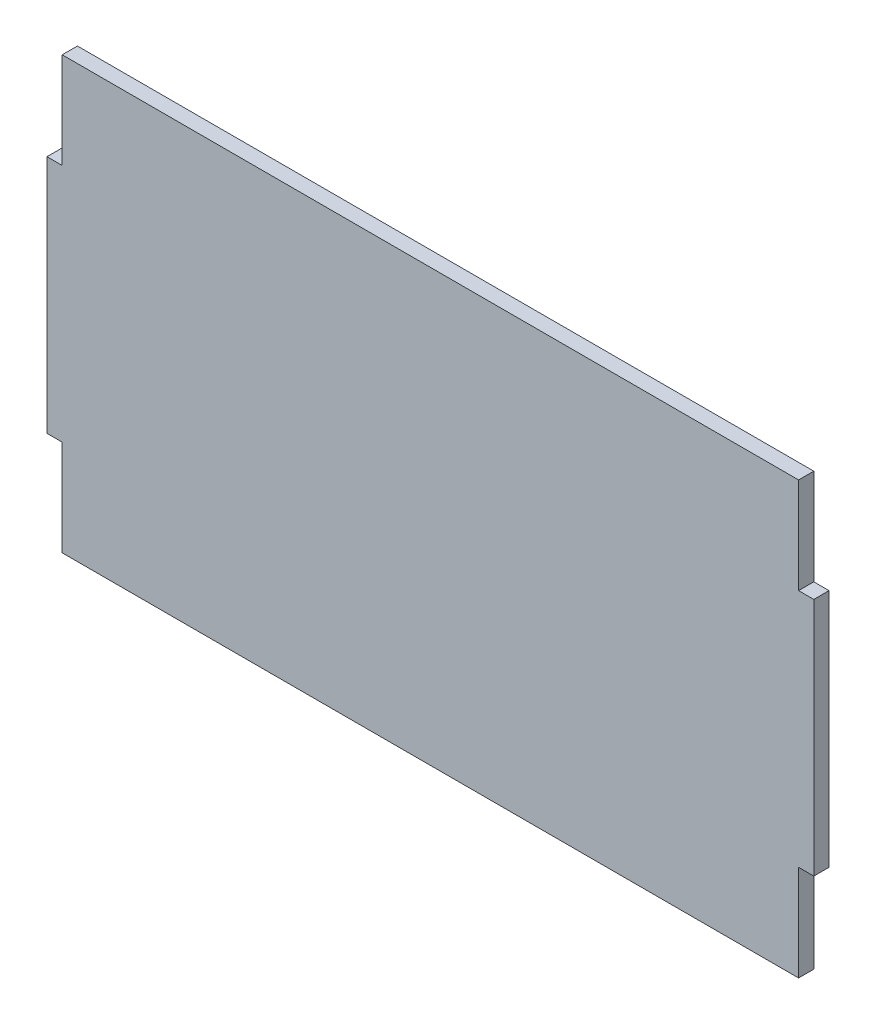
ISO-10303-21;
HEADER;
FILE_DESCRIPTION(('STEP AP214'),'2;1');
FILE_NAME('part.step','',(''),(''),'','','');
FILE_SCHEMA(('AUTOMOTIVE_DESIGN { 1 0 10303 214 1 1 1 1 }'));
ENDSEC;
DATA;
#1=APPLICATION_CONTEXT('core data for automotive mechanical design processes');
#2=APPLICATION_PROTOCOL_DEFINITION('international standard','automotive_design',2000,#1);
#3=PRODUCT_CONTEXT('',#1,'mechanical');
#4=PRODUCT('Part','Part','',(#3));
#5=PRODUCT_RELATED_PRODUCT_CATEGORY('part','',(#4));
#6=PRODUCT_DEFINITION_FORMATION('','',#4);
#7=PRODUCT_DEFINITION_CONTEXT('part definition',#1,'design');
#8=PRODUCT_DEFINITION('design','',#6,#7);
#9=PRODUCT_DEFINITION_SHAPE('','',#8);
#10=(LENGTH_UNIT() NAMED_UNIT(*) SI_UNIT(.MILLI.,.METRE.));
#11=(NAMED_UNIT(*) PLANE_ANGLE_UNIT() SI_UNIT($,.RADIAN.));
#12=(NAMED_UNIT(*) SI_UNIT($,.STERADIAN.) SOLID_ANGLE_UNIT());
#13=UNCERTAINTY_MEASURE_WITH_UNIT(LENGTH_MEASURE(1.E-05),#10,'distance_accuracy_value','');
#14=(GEOMETRIC_REPRESENTATION_CONTEXT(3) GLOBAL_UNCERTAINTY_ASSIGNED_CONTEXT((#13)) GLOBAL_UNIT_ASSIGNED_CONTEXT((#10,
#11,#12)) REPRESENTATION_CONTEXT('',''));
#15=CARTESIAN_POINT('',(0.,0.,0.));
#16=DIRECTION('',(0.,0.,1.));
#17=DIRECTION('',(1.,0.,0.));
#18=AXIS2_PLACEMENT_3D('',#15,#16,#17);
#19=CARTESIAN_POINT('',(1.48906638433654E-13,20.,3.175));
#20=DIRECTION('',(1.,0.,0.));
#21=DIRECTION('',(0.,1.,0.));
#22=AXIS2_PLACEMENT_3D('',#19,#20,#21);
#23=PLANE('',#22);
#24=DIRECTION('',(0.,-1.,0.));
#25=VECTOR('',#24,1.);
#26=CARTESIAN_POINT('',(1.48906638433654E-13,20.,0.));
#27=LINE('',#26,#25);
#28=CARTESIAN_POINT('',(1.48906638433654E-13,20.,0.));
#29=VERTEX_POINT('',#28);
#30=CARTESIAN_POINT('',(0.,0.,0.));
#31=VERTEX_POINT('',#30);
#32=EDGE_CURVE('E153',#29,#31,#27,.T.);
#33=ORIENTED_EDGE('',*,*,#32,.T.);
#34=DIRECTION('',(0.,0.,-1.));
#35=VECTOR('',#34,1.);
#36=CARTESIAN_POINT('',(0.,0.,3.175));
#37=LINE('',#36,#35);
#38=CARTESIAN_POINT('',(0.,0.,3.175));
#39=VERTEX_POINT('',#38);
#40=EDGE_CURVE('E11',#39,#31,#37,.T.);
#41=ORIENTED_EDGE('',*,*,#40,.F.);
#42=DIRECTION('',(0.,-1.,0.));
#43=VECTOR('',#42,1.);
#44=CARTESIAN_POINT('',(1.48906638433654E-13,20.,3.175));
#45=LINE('',#44,#43);
#46=CARTESIAN_POINT('',(1.48906638433654E-13,20.,3.175));
#47=VERTEX_POINT('',#46);
#48=EDGE_CURVE('E175',#47,#39,#45,.T.);
#49=ORIENTED_EDGE('',*,*,#48,.F.);
#50=DIRECTION('',(0.,0.,-1.));
#51=VECTOR('',#50,1.);
#52=CARTESIAN_POINT('',(1.48906638433654E-13,20.,3.175));
#53=LINE('',#52,#51);
#54=EDGE_CURVE('E149',#47,#29,#53,.T.);
#55=ORIENTED_EDGE('',*,*,#54,.T.);
#56=EDGE_LOOP('',(#33,#41,#49,#55));
#57=FACE_BOUND('',#56,.T.);
#58=ADVANCED_FACE('F33',(#57),#23,.F.);
#59=CARTESIAN_POINT('',(0.,0.,3.175));
#60=DIRECTION('',(0.,1.,0.));
#61=DIRECTION('',(0.,0.,1.));
#62=AXIS2_PLACEMENT_3D('',#59,#60,#61);
#63=PLANE('',#62);
#64=DIRECTION('',(1.,0.,0.));
#65=VECTOR('',#64,1.);
#66=CARTESIAN_POINT('',(0.,0.,0.));
#67=LINE('',#66,#65);
#68=CARTESIAN_POINT('',(153.65,0.,0.));
#69=VERTEX_POINT('',#68);
#70=EDGE_CURVE('E156',#31,#69,#67,.T.);
#71=ORIENTED_EDGE('',*,*,#70,.T.);
#72=DIRECTION('',(0.,0.,-1.));
#73=VECTOR('',#72,1.);
#74=CARTESIAN_POINT('',(153.65,0.,3.175));
#75=LINE('',#74,#73);
#76=CARTESIAN_POINT('',(153.65,0.,3.175));
#77=VERTEX_POINT('',#76);
#78=EDGE_CURVE('E41',#77,#69,#75,.T.);
#79=ORIENTED_EDGE('',*,*,#78,.F.);
#80=DIRECTION('',(1.,0.,0.));
#81=VECTOR('',#80,1.);
#82=CARTESIAN_POINT('',(0.,0.,3.175));
#83=LINE('',#82,#81);
#84=EDGE_CURVE('E104',#39,#77,#83,.T.);
#85=ORIENTED_EDGE('',*,*,#84,.F.);
#86=ORIENTED_EDGE('',*,*,#40,.T.);
#87=EDGE_LOOP('',(#71,#79,#85,#86));
#88=FACE_BOUND('',#87,.T.);
#89=ADVANCED_FACE('F253',(#88),#63,.F.);
#90=CARTESIAN_POINT('',(153.65,0.,3.175));
#91=DIRECTION('',(-1.,0.,0.));
#92=DIRECTION('',(0.,0.,1.));
#93=AXIS2_PLACEMENT_3D('',#90,#91,#92);
#94=PLANE('',#93);
#95=DIRECTION('',(0.,1.,0.));
#96=VECTOR('',#95,1.);
#97=CARTESIAN_POINT('',(153.65,0.,0.));
#98=LINE('',#97,#96);
#99=CARTESIAN_POINT('',(153.65,20.,0.));
#100=VERTEX_POINT('',#99);
#101=EDGE_CURVE('E158',#69,#100,#98,.T.);
#102=ORIENTED_EDGE('',*,*,#101,.T.);
#103=DIRECTION('',(0.,0.,-1.));
#104=VECTOR('',#103,1.);
#105=CARTESIAN_POINT('',(153.65,20.,3.175));
#106=LINE('',#105,#104);
#107=CARTESIAN_POINT('',(153.65,20.,3.175));
#108=VERTEX_POINT('',#107);
#109=EDGE_CURVE('E194',#108,#100,#106,.T.);
#110=ORIENTED_EDGE('',*,*,#109,.F.);
#111=DIRECTION('',(0.,1.,0.));
#112=VECTOR('',#111,1.);
#113=CARTESIAN_POINT('',(153.65,0.,3.175));
#114=LINE('',#113,#112);
#115=EDGE_CURVE('E202',#77,#108,#114,.T.);
#116=ORIENTED_EDGE('',*,*,#115,.F.);
#117=ORIENTED_EDGE('',*,*,#78,.T.);
#118=EDGE_LOOP('',(#102,#110,#116,#117));
#119=FACE_BOUND('',#118,.T.);
#120=ADVANCED_FACE('F200',(#119),#94,.F.);
#121=CARTESIAN_POINT('',(153.65,20.,3.175));
#122=DIRECTION('',(0.,1.,0.));
#123=DIRECTION('',(0.,0.,1.));
#124=AXIS2_PLACEMENT_3D('',#121,#122,#123);
#125=PLANE('',#124);
#126=DIRECTION('',(1.,0.,0.));
#127=VECTOR('',#126,1.);
#128=CARTESIAN_POINT('',(153.65,20.,0.));
#129=LINE('',#128,#127);
#130=CARTESIAN_POINT('',(156.825,20.,0.));
#131=VERTEX_POINT('',#130);
#132=EDGE_CURVE('E160',#100,#131,#129,.T.);
#133=ORIENTED_EDGE('',*,*,#132,.T.);
#134=DIRECTION('',(0.,0.,-1.));
#135=VECTOR('',#134,1.);
#136=CARTESIAN_POINT('',(156.825,20.,3.175));
#137=LINE('',#136,#135);
#138=CARTESIAN_POINT('',(156.825,20.,3.175));
#139=VERTEX_POINT('',#138);
#140=EDGE_CURVE('E191',#139,#131,#137,.T.);
#141=ORIENTED_EDGE('',*,*,#140,.F.);
#142=DIRECTION('',(1.,0.,0.));
#143=VECTOR('',#142,1.);
#144=CARTESIAN_POINT('',(153.65,20.,3.175));
#145=LINE('',#144,#143);
#146=EDGE_CURVE('E220',#108,#139,#145,.T.);
#147=ORIENTED_EDGE('',*,*,#146,.F.);
#148=ORIENTED_EDGE('',*,*,#109,.T.);
#149=EDGE_LOOP('',(#133,#141,#147,#148));
#150=FACE_BOUND('',#149,.T.);
#151=ADVANCED_FACE('F211',(#150),#125,.F.);
#152=CARTESIAN_POINT('',(156.825,20.,3.175));
#153=DIRECTION('',(-1.,0.,0.));
#154=DIRECTION('',(0.,0.,1.));
#155=AXIS2_PLACEMENT_3D('',#152,#153,#154);
#156=PLANE('',#155);
#157=DIRECTION('',(0.,1.,0.));
#158=VECTOR('',#157,1.);
#159=CARTESIAN_POINT('',(156.825,20.,0.));
#160=LINE('',#159,#158);
#161=CARTESIAN_POINT('',(156.825,70.,0.));
#162=VERTEX_POINT('',#161);
#163=EDGE_CURVE('E162',#131,#162,#160,.T.);
#164=ORIENTED_EDGE('',*,*,#163,.T.);
#165=DIRECTION('',(0.,0.,-1.));
#166=VECTOR('',#165,1.);
#167=CARTESIAN_POINT('',(156.825,70.,3.175));
#168=LINE('',#167,#166);
#169=CARTESIAN_POINT('',(156.825,70.,3.175));
#170=VERTEX_POINT('',#169);
#171=EDGE_CURVE('E188',#170,#162,#168,.T.);
#172=ORIENTED_EDGE('',*,*,#171,.F.);
#173=DIRECTION('',(0.,1.,0.));
#174=VECTOR('',#173,1.);
#175=CARTESIAN_POINT('',(156.825,20.,3.175));
#176=LINE('',#175,#174);
#177=EDGE_CURVE('E217',#139,#170,#176,.T.);
#178=ORIENTED_EDGE('',*,*,#177,.F.);
#179=ORIENTED_EDGE('',*,*,#140,.T.);
#180=EDGE_LOOP('',(#164,#172,#178,#179));
#181=FACE_BOUND('',#180,.T.);
#182=ADVANCED_FACE('F215',(#181),#156,.F.);
#183=CARTESIAN_POINT('',(156.825,70.,3.175));
#184=DIRECTION('',(0.,-1.,0.));
#185=DIRECTION('',(0.,0.,-1.));
#186=AXIS2_PLACEMENT_3D('',#183,#184,#185);
#187=PLANE('',#186);
#188=DIRECTION('',(-1.,0.,0.));
#189=VECTOR('',#188,1.);
#190=CARTESIAN_POINT('',(156.825,70.,0.));
#191=LINE('',#190,#189);
#192=CARTESIAN_POINT('',(153.65,70.,0.));
#193=VERTEX_POINT('',#192);
#194=EDGE_CURVE('E164',#162,#193,#191,.T.);
#195=ORIENTED_EDGE('',*,*,#194,.T.);
#196=DIRECTION('',(0.,0.,-1.));
#197=VECTOR('',#196,1.);
#198=CARTESIAN_POINT('',(153.65,70.,3.175));
#199=LINE('',#198,#197);
#200=CARTESIAN_POINT('',(153.65,70.,3.175));
#201=VERTEX_POINT('',#200);
#202=EDGE_CURVE('E185',#201,#193,#199,.T.);
#203=ORIENTED_EDGE('',*,*,#202,.F.);
#204=DIRECTION('',(-1.,0.,0.));
#205=VECTOR('',#204,1.);
#206=CARTESIAN_POINT('',(156.825,70.,3.175));
#207=LINE('',#206,#205);
#208=EDGE_CURVE('E219',#170,#201,#207,.T.);
#209=ORIENTED_EDGE('',*,*,#208,.F.);
#210=ORIENTED_EDGE('',*,*,#171,.T.);
#211=EDGE_LOOP('',(#195,#203,#209,#210));
#212=FACE_BOUND('',#211,.T.);
#213=ADVANCED_FACE('F266',(#212),#187,.F.);
#214=CARTESIAN_POINT('',(153.65,70.,3.175));
#215=DIRECTION('',(-1.,0.,0.));
#216=DIRECTION('',(0.,0.,1.));
#217=AXIS2_PLACEMENT_3D('',#214,#215,#216);
#218=PLANE('',#217);
#219=DIRECTION('',(0.,1.,0.));
#220=VECTOR('',#219,1.);
#221=CARTESIAN_POINT('',(153.65,70.,0.));
#222=LINE('',#221,#220);
#223=CARTESIAN_POINT('',(153.65,90.,0.));
#224=VERTEX_POINT('',#223);
#225=EDGE_CURVE('E166',#193,#224,#222,.T.);
#226=ORIENTED_EDGE('',*,*,#225,.T.);
#227=DIRECTION('',(0.,0.,-1.));
#228=VECTOR('',#227,1.);
#229=CARTESIAN_POINT('',(153.65,90.,3.175));
#230=LINE('',#229,#228);
#231=CARTESIAN_POINT('',(153.65,90.,3.175));
#232=VERTEX_POINT('',#231);
#233=EDGE_CURVE('E182',#232,#224,#230,.T.);
#234=ORIENTED_EDGE('',*,*,#233,.F.);
#235=DIRECTION('',(0.,1.,0.));
#236=VECTOR('',#235,1.);
#237=CARTESIAN_POINT('',(153.65,70.,3.175));
#238=LINE('',#237,#236);
#239=EDGE_CURVE('E222',#201,#232,#238,.T.);
#240=ORIENTED_EDGE('',*,*,#239,.F.);
#241=ORIENTED_EDGE('',*,*,#202,.T.);
#242=EDGE_LOOP('',(#226,#234,#240,#241));
#243=FACE_BOUND('',#242,.T.);
#244=ADVANCED_FACE('F269',(#243),#218,.F.);
#245=CARTESIAN_POINT('',(153.65,90.,3.175));
#246=DIRECTION('',(0.,-1.,0.));
#247=DIRECTION('',(1.,0.,0.));
#248=AXIS2_PLACEMENT_3D('',#245,#246,#247);
#249=PLANE('',#248);
#250=DIRECTION('',(-1.,0.,0.));
#251=VECTOR('',#250,1.);
#252=CARTESIAN_POINT('',(153.65,90.,0.));
#253=LINE('',#252,#251);
#254=CARTESIAN_POINT('',(0.,90.,0.));
#255=VERTEX_POINT('',#254);
#256=EDGE_CURVE('E168',#224,#255,#253,.T.);
#257=ORIENTED_EDGE('',*,*,#256,.T.);
#258=DIRECTION('',(0.,0.,-1.));
#259=VECTOR('',#258,1.);
#260=CARTESIAN_POINT('',(0.,90.,3.175));
#261=LINE('',#260,#259);
#262=CARTESIAN_POINT('',(0.,90.,3.175));
#263=VERTEX_POINT('',#262);
#264=EDGE_CURVE('E179',#263,#255,#261,.T.);
#265=ORIENTED_EDGE('',*,*,#264,.F.);
#266=DIRECTION('',(-1.,0.,0.));
#267=VECTOR('',#266,1.);
#268=CARTESIAN_POINT('',(153.65,90.,3.175));
#269=LINE('',#268,#267);
#270=EDGE_CURVE('E228',#232,#263,#269,.T.);
#271=ORIENTED_EDGE('',*,*,#270,.F.);
#272=ORIENTED_EDGE('',*,*,#233,.T.);
#273=EDGE_LOOP('',(#257,#265,#271,#272));
#274=FACE_BOUND('',#273,.T.);
#275=ADVANCED_FACE('F234',(#274),#249,.F.);
#276=CARTESIAN_POINT('',(0.,90.,3.175));
#277=DIRECTION('',(1.,0.,0.));
#278=DIRECTION('',(0.,1.,0.));
#279=AXIS2_PLACEMENT_3D('',#276,#277,#278);
#280=PLANE('',#279);
#281=DIRECTION('',(0.,-1.,0.));
#282=VECTOR('',#281,1.);
#283=CARTESIAN_POINT('',(0.,90.,0.));
#284=LINE('',#283,#282);
#285=CARTESIAN_POINT('',(1.42783404437917E-13,70.,0.));
#286=VERTEX_POINT('',#285);
#287=EDGE_CURVE('E170',#255,#286,#284,.T.);
#288=ORIENTED_EDGE('',*,*,#287,.T.);
#289=DIRECTION('',(0.,0.,-1.));
#290=VECTOR('',#289,1.);
#291=CARTESIAN_POINT('',(1.42783404437917E-13,70.,3.175));
#292=LINE('',#291,#290);
#293=CARTESIAN_POINT('',(1.42783404437917E-13,70.,3.175));
#294=VERTEX_POINT('',#293);
#295=EDGE_CURVE('E144',#294,#286,#292,.T.);
#296=ORIENTED_EDGE('',*,*,#295,.F.);
#297=DIRECTION('',(0.,-1.,0.));
#298=VECTOR('',#297,1.);
#299=CARTESIAN_POINT('',(0.,90.,3.175));
#300=LINE('',#299,#298);
#301=EDGE_CURVE('E135',#263,#294,#300,.T.);
#302=ORIENTED_EDGE('',*,*,#301,.F.);
#303=ORIENTED_EDGE('',*,*,#264,.T.);
#304=EDGE_LOOP('',(#288,#296,#302,#303));
#305=FACE_BOUND('',#304,.T.);
#306=ADVANCED_FACE('F238',(#305),#280,.F.);
#307=CARTESIAN_POINT('',(1.42783404437917E-13,70.,3.175));
#308=DIRECTION('',(0.,-1.,0.));
#309=DIRECTION('',(0.,0.,-1.));
#310=AXIS2_PLACEMENT_3D('',#307,#308,#309);
#311=PLANE('',#310);
#312=DIRECTION('',(-1.,0.,0.));
#313=VECTOR('',#312,1.);
#314=CARTESIAN_POINT('',(1.42783404437917E-13,70.,0.));
#315=LINE('',#314,#313);
#316=CARTESIAN_POINT('',(-3.17499999999986,70.,0.));
#317=VERTEX_POINT('',#316);
#318=EDGE_CURVE('E143',#286,#317,#315,.T.);
#319=ORIENTED_EDGE('',*,*,#318,.T.);
#320=DIRECTION('',(0.,0.,-1.));
#321=VECTOR('',#320,1.);
#322=CARTESIAN_POINT('',(-3.17499999999986,70.,3.175));
#323=LINE('',#322,#321);
#324=CARTESIAN_POINT('',(-3.17499999999986,70.,3.175));
#325=VERTEX_POINT('',#324);
#326=EDGE_CURVE('E140',#325,#317,#323,.T.);
#327=ORIENTED_EDGE('',*,*,#326,.F.);
#328=DIRECTION('',(-1.,0.,0.));
#329=VECTOR('',#328,1.);
#330=CARTESIAN_POINT('',(1.42783404437917E-13,70.,3.175));
#331=LINE('',#330,#329);
#332=EDGE_CURVE('E129',#294,#325,#331,.T.);
#333=ORIENTED_EDGE('',*,*,#332,.F.);
#334=ORIENTED_EDGE('',*,*,#295,.T.);
#335=EDGE_LOOP('',(#319,#327,#333,#334));
#336=FACE_BOUND('',#335,.T.);
#337=ADVANCED_FACE('F141',(#336),#311,.F.);
#338=CARTESIAN_POINT('',(-3.17499999999986,70.,3.175));
#339=DIRECTION('',(1.,0.,0.));
#340=DIRECTION('',(0.,1.,0.));
#341=AXIS2_PLACEMENT_3D('',#338,#339,#340);
#342=PLANE('',#341);
#343=DIRECTION('',(0.,-1.,0.));
#344=VECTOR('',#343,1.);
#345=CARTESIAN_POINT('',(-3.17499999999986,70.,0.));
#346=LINE('',#345,#344);
#347=CARTESIAN_POINT('',(-3.17499999999985,20.,0.));
#348=VERTEX_POINT('',#347);
#349=EDGE_CURVE('E90',#317,#348,#346,.T.);
#350=ORIENTED_EDGE('',*,*,#349,.T.);
#351=DIRECTION('',(0.,0.,-1.));
#352=VECTOR('',#351,1.);
#353=CARTESIAN_POINT('',(-3.17499999999985,20.,3.175));
#354=LINE('',#353,#352);
#355=CARTESIAN_POINT('',(-3.17499999999985,20.,3.175));
#356=VERTEX_POINT('',#355);
#357=EDGE_CURVE('E145',#356,#348,#354,.T.);
#358=ORIENTED_EDGE('',*,*,#357,.F.);
#359=DIRECTION('',(0.,-1.,0.));
#360=VECTOR('',#359,1.);
#361=CARTESIAN_POINT('',(-3.17499999999986,70.,3.175));
#362=LINE('',#361,#360);
#363=EDGE_CURVE('E133',#325,#356,#362,.T.);
#364=ORIENTED_EDGE('',*,*,#363,.F.);
#365=ORIENTED_EDGE('',*,*,#326,.T.);
#366=EDGE_LOOP('',(#350,#358,#364,#365));
#367=FACE_BOUND('',#366,.T.);
#368=ADVANCED_FACE('F147',(#367),#342,.F.);
#369=CARTESIAN_POINT('',(-3.17499999999985,20.,3.175));
#370=DIRECTION('',(0.,1.,0.));
#371=DIRECTION('',(0.,0.,1.));
#372=AXIS2_PLACEMENT_3D('',#369,#370,#371);
#373=PLANE('',#372);
#374=DIRECTION('',(1.,0.,0.));
#375=VECTOR('',#374,1.);
#376=CARTESIAN_POINT('',(-3.17499999999985,20.,0.));
#377=LINE('',#376,#375);
#378=EDGE_CURVE('E96',#348,#29,#377,.T.);
#379=ORIENTED_EDGE('',*,*,#378,.T.);
#380=ORIENTED_EDGE('',*,*,#54,.F.);
#381=DIRECTION('',(1.,0.,0.));
#382=VECTOR('',#381,1.);
#383=CARTESIAN_POINT('',(-3.17499999999985,20.,3.175));
#384=LINE('',#383,#382);
#385=EDGE_CURVE('E49',#356,#47,#384,.T.);
#386=ORIENTED_EDGE('',*,*,#385,.F.);
#387=ORIENTED_EDGE('',*,*,#357,.T.);
#388=EDGE_LOOP('',(#379,#380,#386,#387));
#389=FACE_BOUND('',#388,.T.);
#390=ADVANCED_FACE('F242',(#389),#373,.F.);
#391=CARTESIAN_POINT('',(0.,0.,3.175));
#392=DIRECTION('',(0.,0.,1.));
#393=DIRECTION('',(1.,0.,0.));
#394=AXIS2_PLACEMENT_3D('',#391,#392,#393);
#395=PLANE('',#394);
#396=ORIENTED_EDGE('',*,*,#48,.T.);
#397=ORIENTED_EDGE('',*,*,#84,.T.);
#398=ORIENTED_EDGE('',*,*,#115,.T.);
#399=ORIENTED_EDGE('',*,*,#146,.T.);
#400=ORIENTED_EDGE('',*,*,#177,.T.);
#401=ORIENTED_EDGE('',*,*,#208,.T.);
#402=ORIENTED_EDGE('',*,*,#239,.T.);
#403=ORIENTED_EDGE('',*,*,#270,.T.);
#404=ORIENTED_EDGE('',*,*,#301,.T.);
#405=ORIENTED_EDGE('',*,*,#332,.T.);
#406=ORIENTED_EDGE('',*,*,#363,.T.);
#407=ORIENTED_EDGE('',*,*,#385,.T.);
#408=EDGE_LOOP('',(#396,#397,#398,#399,#400,#401,#402,#403,#404,#405,#406,#407));
#409=FACE_BOUND('',#408,.T.);
#410=ADVANCED_FACE('F131',(#409),#395,.T.);
#411=CARTESIAN_POINT('',(0.,0.,0.));
#412=DIRECTION('',(0.,0.,1.));
#413=DIRECTION('',(1.,0.,0.));
#414=AXIS2_PLACEMENT_3D('',#411,#412,#413);
#415=PLANE('',#414);
#416=ORIENTED_EDGE('',*,*,#32,.F.);
#417=ORIENTED_EDGE('',*,*,#378,.F.);
#418=ORIENTED_EDGE('',*,*,#349,.F.);
#419=ORIENTED_EDGE('',*,*,#318,.F.);
#420=ORIENTED_EDGE('',*,*,#287,.F.);
#421=ORIENTED_EDGE('',*,*,#256,.F.);
#422=ORIENTED_EDGE('',*,*,#225,.F.);
#423=ORIENTED_EDGE('',*,*,#194,.F.);
#424=ORIENTED_EDGE('',*,*,#163,.F.);
#425=ORIENTED_EDGE('',*,*,#132,.F.);
#426=ORIENTED_EDGE('',*,*,#101,.F.);
#427=ORIENTED_EDGE('',*,*,#70,.F.);
#428=EDGE_LOOP('',(#416,#417,#418,#419,#420,#421,#422,#423,#424,#425,#426,#427));
#429=FACE_BOUND('',#428,.T.);
#430=ADVANCED_FACE('F206',(#429),#415,.F.);
#431=CLOSED_SHELL('',(#58,#89,#120,#151,#182,#213,#244,#275,#306,#337,#368,#390,#410,#430));
#432=MANIFOLD_SOLID_BREP('B2',#431);
#433=ADVANCED_BREP_SHAPE_REPRESENTATION('',(#18,#432),#14);
#434=SHAPE_DEFINITION_REPRESENTATION(#9,#433);
ENDSEC;
END-ISO-10303-21;
